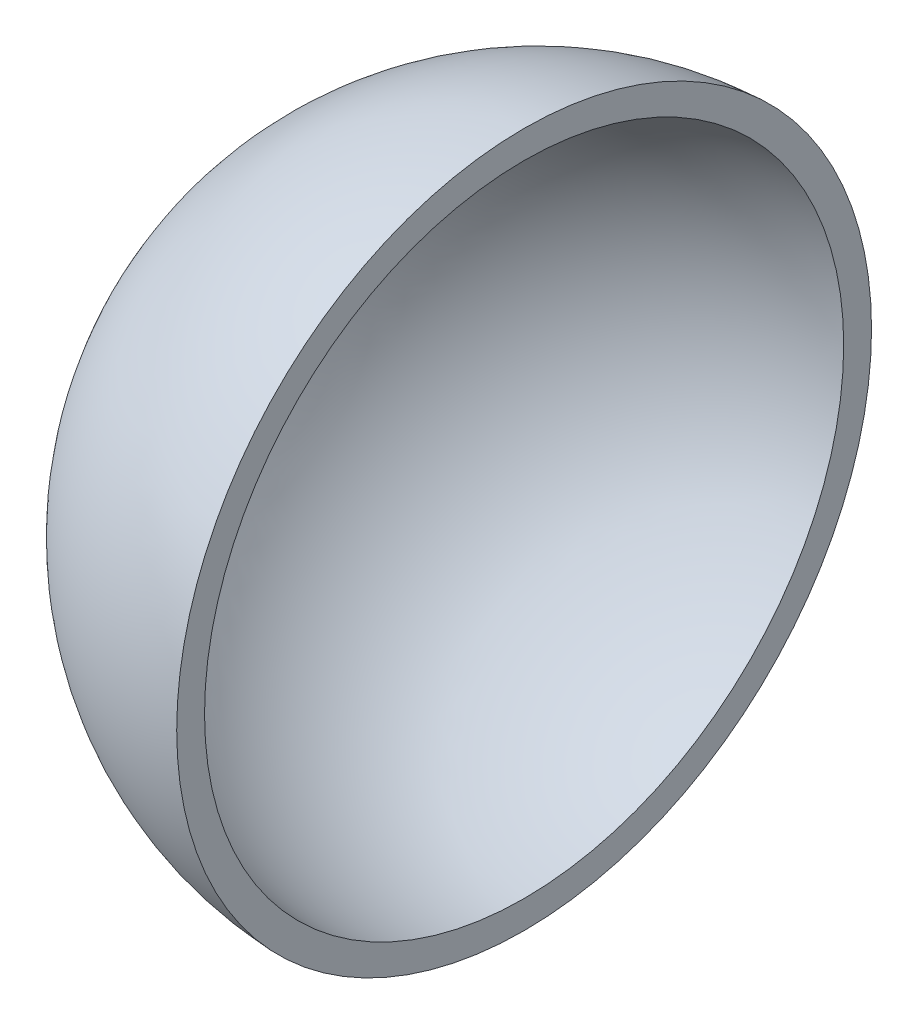
ISO-10303-21;
HEADER;
FILE_DESCRIPTION(('STEP AP214'),'2;1');
FILE_NAME('part.step','',(''),(''),'','','');
FILE_SCHEMA(('AUTOMOTIVE_DESIGN { 1 0 10303 214 1 1 1 1 }'));
ENDSEC;
DATA;
#1=APPLICATION_CONTEXT('core data for automotive mechanical design processes');
#2=APPLICATION_PROTOCOL_DEFINITION('international standard','automotive_design',2000,#1);
#3=PRODUCT_CONTEXT('',#1,'mechanical');
#4=PRODUCT('Part','Part','',(#3));
#5=PRODUCT_RELATED_PRODUCT_CATEGORY('part','',(#4));
#6=PRODUCT_DEFINITION_FORMATION('','',#4);
#7=PRODUCT_DEFINITION_CONTEXT('part definition',#1,'design');
#8=PRODUCT_DEFINITION('design','',#6,#7);
#9=PRODUCT_DEFINITION_SHAPE('','',#8);
#10=(LENGTH_UNIT() NAMED_UNIT(*) SI_UNIT(.MILLI.,.METRE.));
#11=(NAMED_UNIT(*) PLANE_ANGLE_UNIT() SI_UNIT($,.RADIAN.));
#12=(NAMED_UNIT(*) SI_UNIT($,.STERADIAN.) SOLID_ANGLE_UNIT());
#13=UNCERTAINTY_MEASURE_WITH_UNIT(LENGTH_MEASURE(1.E-05),#10,'distance_accuracy_value','');
#14=(GEOMETRIC_REPRESENTATION_CONTEXT(3) GLOBAL_UNCERTAINTY_ASSIGNED_CONTEXT((#13)) GLOBAL_UNIT_ASSIGNED_CONTEXT((#10,
#11,#12)) REPRESENTATION_CONTEXT('',''));
#15=CARTESIAN_POINT('',(0.,0.,0.));
#16=DIRECTION('',(0.,0.,1.));
#17=DIRECTION('',(1.,0.,0.));
#18=AXIS2_PLACEMENT_3D('',#15,#16,#17);
#19=CARTESIAN_POINT('',(0.,0.,0.));
#20=DIRECTION('',(1.,0.,0.));
#21=DIRECTION('',(0.,0.,1.));
#22=AXIS2_PLACEMENT_3D('',#19,#20,#21);
#23=SPHERICAL_SURFACE('',#22,25.);
#24=CARTESIAN_POINT('',(-0.999999999999996,0.,0.));
#25=DIRECTION('',(1.,0.,0.));
#26=DIRECTION('',(0.,0.,-1.));
#27=AXIS2_PLACEMENT_3D('',#24,#25,#26);
#28=CIRCLE('',#27,24.9799919935936);
#29=CARTESIAN_POINT('',(-0.999999999999996,0.,-24.9799919935936));
#30=VERTEX_POINT('',#29);
#31=EDGE_CURVE('E10',#30,#30,#28,.T.);
#32=ORIENTED_EDGE('',*,*,#31,.F.);
#33=EDGE_LOOP('',(#32));
#34=FACE_BOUND('',#33,.T.);
#35=ADVANCED_FACE('F33',(#34),#23,.T.);
#36=CARTESIAN_POINT('',(-0.999999999999996,0.,22.9782505861521));
#37=DIRECTION('',(-1.,0.,0.));
#38=DIRECTION('',(0.,0.,1.));
#39=AXIS2_PLACEMENT_3D('',#36,#37,#38);
#40=PLANE('',#39);
#41=CARTESIAN_POINT('',(-0.999999999999996,0.,0.));
#42=DIRECTION('',(1.,0.,0.));
#43=DIRECTION('',(0.,0.,-1.));
#44=AXIS2_PLACEMENT_3D('',#41,#42,#43);
#45=CIRCLE('',#44,22.9782505861521);
#46=CARTESIAN_POINT('',(-0.999999999999996,0.,-22.9782505861521));
#47=VERTEX_POINT('',#46);
#48=EDGE_CURVE('E39',#47,#47,#45,.T.);
#49=ORIENTED_EDGE('',*,*,#48,.F.);
#50=EDGE_LOOP('',(#49));
#51=FACE_BOUND('',#50,.T.);
#52=ORIENTED_EDGE('',*,*,#31,.T.);
#53=EDGE_LOOP('',(#52));
#54=FACE_BOUND('',#53,.T.);
#55=ADVANCED_FACE('F47',(#51,#54),#40,.F.);
#56=CARTESIAN_POINT('',(0.,0.,0.));
#57=DIRECTION('',(1.,0.,0.));
#58=DIRECTION('',(0.,0.,1.));
#59=AXIS2_PLACEMENT_3D('',#56,#57,#58);
#60=SPHERICAL_SURFACE('',#59,23.);
#61=ORIENTED_EDGE('',*,*,#48,.T.);
#62=EDGE_LOOP('',(#61));
#63=FACE_BOUND('',#62,.T.);
#64=ADVANCED_FACE('F45',(#63),#60,.F.);
#65=CLOSED_SHELL('',(#35,#55,#64));
#66=MANIFOLD_SOLID_BREP('B2',#65);
#67=ADVANCED_BREP_SHAPE_REPRESENTATION('',(#18,#66),#14);
#68=SHAPE_DEFINITION_REPRESENTATION(#9,#67);
ENDSEC;
END-ISO-10303-21;
